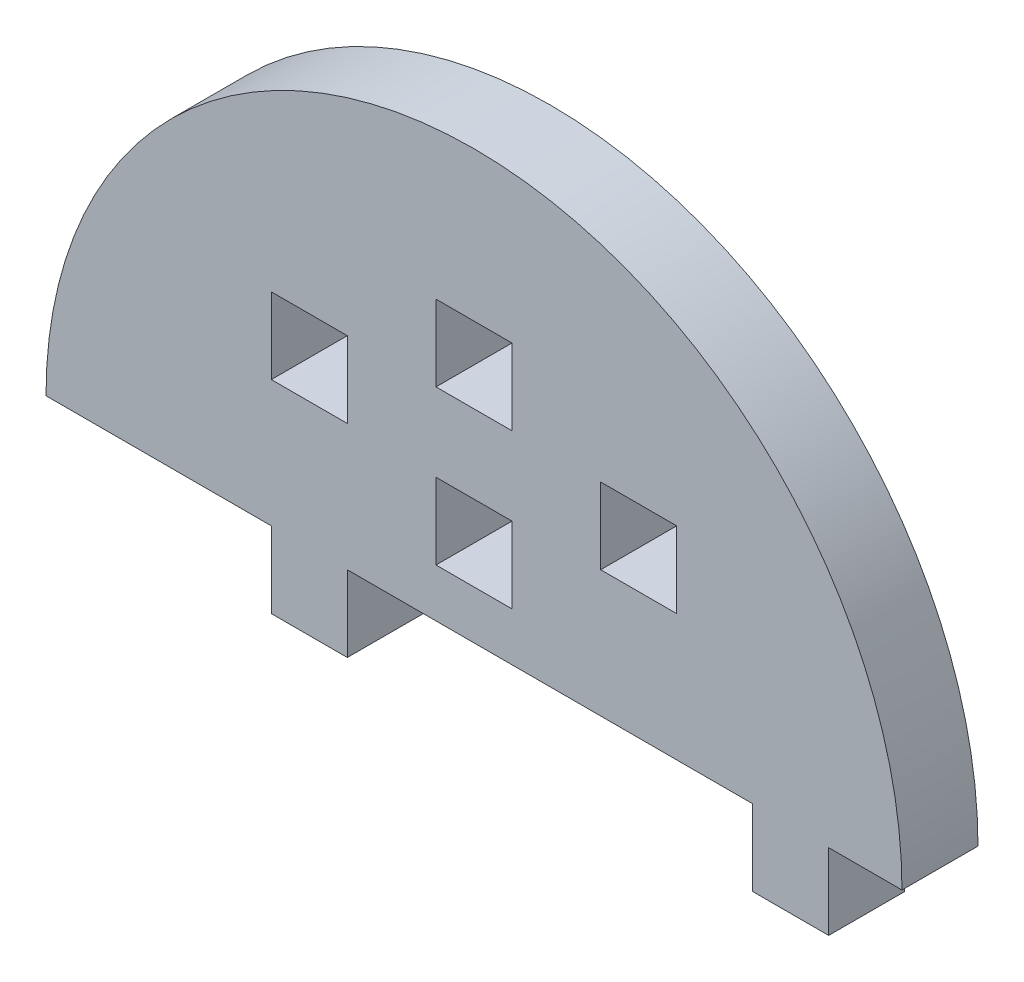
ISO-10303-21;
HEADER;
FILE_DESCRIPTION(('STEP AP214'),'2;1');
FILE_NAME('part.step','',(''),(''),'','','');
FILE_SCHEMA(('AUTOMOTIVE_DESIGN { 1 0 10303 214 1 1 1 1 }'));
ENDSEC;
DATA;
#1=APPLICATION_CONTEXT('core data for automotive mechanical design processes');
#2=APPLICATION_PROTOCOL_DEFINITION('international standard','automotive_design',2000,#1);
#3=PRODUCT_CONTEXT('',#1,'mechanical');
#4=PRODUCT('Part','Part','',(#3));
#5=PRODUCT_RELATED_PRODUCT_CATEGORY('part','',(#4));
#6=PRODUCT_DEFINITION_FORMATION('','',#4);
#7=PRODUCT_DEFINITION_CONTEXT('part definition',#1,'design');
#8=PRODUCT_DEFINITION('design','',#6,#7);
#9=PRODUCT_DEFINITION_SHAPE('','',#8);
#10=(LENGTH_UNIT() NAMED_UNIT(*) SI_UNIT(.MILLI.,.METRE.));
#11=(NAMED_UNIT(*) PLANE_ANGLE_UNIT() SI_UNIT($,.RADIAN.));
#12=(NAMED_UNIT(*) SI_UNIT($,.STERADIAN.) SOLID_ANGLE_UNIT());
#13=UNCERTAINTY_MEASURE_WITH_UNIT(LENGTH_MEASURE(1.E-05),#10,'distance_accuracy_value','');
#14=(GEOMETRIC_REPRESENTATION_CONTEXT(3) GLOBAL_UNCERTAINTY_ASSIGNED_CONTEXT((#13)) GLOBAL_UNIT_ASSIGNED_CONTEXT((#10,
#11,#12)) REPRESENTATION_CONTEXT('',''));
#15=CARTESIAN_POINT('',(0.,0.,0.));
#16=DIRECTION('',(0.,0.,1.));
#17=DIRECTION('',(1.,0.,0.));
#18=AXIS2_PLACEMENT_3D('',#15,#16,#17);
#19=CARTESIAN_POINT('',(3948.27341572013,1132.70473007748,6.));
#20=DIRECTION('',(0.,0.,1.));
#21=DIRECTION('',(1.,0.,0.));
#22=AXIS2_PLACEMENT_3D('',#19,#20,#21);
#23=PLANE('',#22);
#24=DIRECTION('',(-1.,0.,0.));
#25=VECTOR('',#24,1.);
#26=CARTESIAN_POINT('',(3951.27341572013,1148.70473007748,6.));
#27=LINE('',#26,#25);
#28=CARTESIAN_POINT('',(3951.27341572013,1148.70473007748,6.));
#29=VERTEX_POINT('',#28);
#30=CARTESIAN_POINT('',(3945.27341572013,1148.70473007748,6.));
#31=VERTEX_POINT('',#30);
#32=EDGE_CURVE('E383',#29,#31,#27,.T.);
#33=ORIENTED_EDGE('',*,*,#32,.T.);
#34=DIRECTION('',(0.,1.,0.));
#35=VECTOR('',#34,1.);
#36=CARTESIAN_POINT('',(3945.27341572013,1148.70473007748,6.));
#37=LINE('',#36,#35);
#38=CARTESIAN_POINT('',(3945.27341572013,1154.70473007748,6.));
#39=VERTEX_POINT('',#38);
#40=EDGE_CURVE('E393',#31,#39,#37,.T.);
#41=ORIENTED_EDGE('',*,*,#40,.T.);
#42=DIRECTION('',(1.,0.,0.));
#43=VECTOR('',#42,1.);
#44=CARTESIAN_POINT('',(3945.27341572013,1154.70473007748,6.));
#45=LINE('',#44,#43);
#46=CARTESIAN_POINT('',(3951.27341572013,1154.70473007748,6.));
#47=VERTEX_POINT('',#46);
#48=EDGE_CURVE('E223',#39,#47,#45,.T.);
#49=ORIENTED_EDGE('',*,*,#48,.T.);
#50=DIRECTION('',(0.,-1.,0.));
#51=VECTOR('',#50,1.);
#52=CARTESIAN_POINT('',(3951.27341572013,1154.70473007748,6.));
#53=LINE('',#52,#51);
#54=EDGE_CURVE('E390',#47,#29,#53,.T.);
#55=ORIENTED_EDGE('',*,*,#54,.T.);
#56=EDGE_LOOP('',(#33,#41,#49,#55));
#57=FACE_BOUND('',#56,.T.);
#58=DIRECTION('',(0.,1.,0.));
#59=VECTOR('',#58,1.);
#60=CARTESIAN_POINT('',(3958.27341572013,0.,6.));
#61=LINE('',#60,#59);
#62=CARTESIAN_POINT('',(3958.27341572013,1142.70473007748,6.));
#63=VERTEX_POINT('',#62);
#64=CARTESIAN_POINT('',(3958.27341572013,1148.70473007748,6.));
#65=VERTEX_POINT('',#64);
#66=EDGE_CURVE('E429',#63,#65,#61,.T.);
#67=ORIENTED_EDGE('',*,*,#66,.T.);
#68=DIRECTION('',(1.,0.,0.));
#69=VECTOR('',#68,1.);
#70=CARTESIAN_POINT('',(0.,1148.70473007748,6.));
#71=LINE('',#70,#69);
#72=CARTESIAN_POINT('',(3964.27341572013,1148.70473007748,6.));
#73=VERTEX_POINT('',#72);
#74=EDGE_CURVE('E442',#65,#73,#71,.T.);
#75=ORIENTED_EDGE('',*,*,#74,.T.);
#76=DIRECTION('',(0.,-1.,0.));
#77=VECTOR('',#76,1.);
#78=CARTESIAN_POINT('',(3964.27341572013,0.,6.));
#79=LINE('',#78,#77);
#80=CARTESIAN_POINT('',(3964.27341572013,1142.70473007748,6.));
#81=VERTEX_POINT('',#80);
#82=EDGE_CURVE('E438',#73,#81,#79,.T.);
#83=ORIENTED_EDGE('',*,*,#82,.T.);
#84=DIRECTION('',(-1.,0.,0.));
#85=VECTOR('',#84,1.);
#86=CARTESIAN_POINT('',(0.,1142.70473007748,6.));
#87=LINE('',#86,#85);
#88=EDGE_CURVE('E433',#81,#63,#87,.T.);
#89=ORIENTED_EDGE('',*,*,#88,.T.);
#90=EDGE_LOOP('',(#67,#75,#83,#89));
#91=FACE_BOUND('',#90,.T.);
#92=DIRECTION('',(1.,0.,0.));
#93=VECTOR('',#92,1.);
#94=CARTESIAN_POINT('',(3976.27341572013,1132.70473007748,6.));
#95=LINE('',#94,#93);
#96=CARTESIAN_POINT('',(3976.27341572013,1132.70473007748,6.));
#97=VERTEX_POINT('',#96);
#98=CARTESIAN_POINT('',(3982.05913000584,1132.70473007748,6.));
#99=VERTEX_POINT('',#98);
#100=EDGE_CURVE('E559',#97,#99,#95,.T.);
#101=ORIENTED_EDGE('',*,*,#100,.T.);
#102=CARTESIAN_POINT('',(3948.27341572013,1132.70473007748,6.));
#103=DIRECTION('',(0.,0.,1.));
#104=DIRECTION('',(1.,0.,0.));
#105=AXIS2_PLACEMENT_3D('',#102,#103,#104);
#106=CIRCLE('',#105,33.7857142857145);
#107=CARTESIAN_POINT('',(3914.48770143441,1132.70473007748,6.));
#108=VERTEX_POINT('',#107);
#109=EDGE_CURVE('E563',#99,#108,#106,.T.);
#110=ORIENTED_EDGE('',*,*,#109,.T.);
#111=DIRECTION('',(1.,0.,0.));
#112=VECTOR('',#111,1.);
#113=CARTESIAN_POINT('',(3914.48770143441,1132.70473007748,6.));
#114=LINE('',#113,#112);
#115=CARTESIAN_POINT('',(3932.27341572013,1132.70473007748,6.));
#116=VERTEX_POINT('',#115);
#117=EDGE_CURVE('E567',#108,#116,#114,.T.);
#118=ORIENTED_EDGE('',*,*,#117,.T.);
#119=DIRECTION('',(0.,1.,0.));
#120=VECTOR('',#119,1.);
#121=CARTESIAN_POINT('',(3932.27341572013,1126.70473007748,6.));
#122=LINE('',#121,#120);
#123=CARTESIAN_POINT('',(3932.27341572013,1126.70473007748,6.));
#124=VERTEX_POINT('',#123);
#125=EDGE_CURVE('E570',#124,#116,#122,.T.);
#126=ORIENTED_EDGE('',*,*,#125,.F.);
#127=DIRECTION('',(-1.,0.,0.));
#128=VECTOR('',#127,1.);
#129=CARTESIAN_POINT('',(3938.27341572013,1126.70473007748,6.));
#130=LINE('',#129,#128);
#131=CARTESIAN_POINT('',(3938.27341572013,1126.70473007748,6.));
#132=VERTEX_POINT('',#131);
#133=EDGE_CURVE('E574',#132,#124,#130,.T.);
#134=ORIENTED_EDGE('',*,*,#133,.F.);
#135=DIRECTION('',(0.,-1.,0.));
#136=VECTOR('',#135,1.);
#137=CARTESIAN_POINT('',(3938.27341572013,1132.70473007748,6.));
#138=LINE('',#137,#136);
#139=CARTESIAN_POINT('',(3938.27341572013,1132.70473007748,6.));
#140=VERTEX_POINT('',#139);
#141=EDGE_CURVE('E578',#140,#132,#138,.T.);
#142=ORIENTED_EDGE('',*,*,#141,.F.);
#143=DIRECTION('',(1.,0.,0.));
#144=VECTOR('',#143,1.);
#145=CARTESIAN_POINT('',(3938.27341572013,1132.70473007748,6.));
#146=LINE('',#145,#144);
#147=CARTESIAN_POINT('',(3970.27341572013,1132.70473007748,6.));
#148=VERTEX_POINT('',#147);
#149=EDGE_CURVE('E582',#140,#148,#146,.T.);
#150=ORIENTED_EDGE('',*,*,#149,.T.);
#151=DIRECTION('',(0.,-1.,0.));
#152=VECTOR('',#151,1.);
#153=CARTESIAN_POINT('',(3970.27341572013,1132.70473007748,6.));
#154=LINE('',#153,#152);
#155=CARTESIAN_POINT('',(3970.27341572013,1126.70473007748,6.));
#156=VERTEX_POINT('',#155);
#157=EDGE_CURVE('E585',#148,#156,#154,.T.);
#158=ORIENTED_EDGE('',*,*,#157,.T.);
#159=DIRECTION('',(1.,0.,0.));
#160=VECTOR('',#159,1.);
#161=CARTESIAN_POINT('',(3970.27341572013,1126.70473007748,6.));
#162=LINE('',#161,#160);
#163=CARTESIAN_POINT('',(3976.27341572013,1126.70473007748,6.));
#164=VERTEX_POINT('',#163);
#165=EDGE_CURVE('E588',#156,#164,#162,.T.);
#166=ORIENTED_EDGE('',*,*,#165,.T.);
#167=DIRECTION('',(0.,1.,0.));
#168=VECTOR('',#167,1.);
#169=CARTESIAN_POINT('',(3976.27341572013,1126.70473007748,6.));
#170=LINE('',#169,#168);
#171=EDGE_CURVE('E591',#164,#97,#170,.T.);
#172=ORIENTED_EDGE('',*,*,#171,.T.);
#173=EDGE_LOOP('',(#101,#110,#118,#126,#134,#142,#150,#158,#166,#172));
#174=FACE_BOUND('',#173,.T.);
#175=DIRECTION('',(0.,1.,0.));
#176=VECTOR('',#175,1.);
#177=CARTESIAN_POINT('',(3938.27341572013,0.,6.));
#178=LINE('',#177,#176);
#179=CARTESIAN_POINT('',(3938.27341572013,1142.70473007748,6.));
#180=VERTEX_POINT('',#179);
#181=CARTESIAN_POINT('',(3938.27341572013,1148.70473007748,6.));
#182=VERTEX_POINT('',#181);
#183=EDGE_CURVE('E519',#180,#182,#178,.T.);
#184=ORIENTED_EDGE('',*,*,#183,.F.);
#185=DIRECTION('',(1.,0.,0.));
#186=VECTOR('',#185,1.);
#187=CARTESIAN_POINT('',(0.,1142.70473007748,6.));
#188=LINE('',#187,#186);
#189=CARTESIAN_POINT('',(3932.27341572013,1142.70473007748,6.));
#190=VERTEX_POINT('',#189);
#191=EDGE_CURVE('E516',#190,#180,#188,.T.);
#192=ORIENTED_EDGE('',*,*,#191,.F.);
#193=DIRECTION('',(0.,-1.,0.));
#194=VECTOR('',#193,1.);
#195=CARTESIAN_POINT('',(3932.27341572013,0.,6.));
#196=LINE('',#195,#194);
#197=CARTESIAN_POINT('',(3932.27341572013,1148.70473007748,6.));
#198=VERTEX_POINT('',#197);
#199=EDGE_CURVE('E527',#198,#190,#196,.T.);
#200=ORIENTED_EDGE('',*,*,#199,.F.);
#201=DIRECTION('',(-1.,0.,0.));
#202=VECTOR('',#201,1.);
#203=CARTESIAN_POINT('',(0.,1148.70473007748,6.));
#204=LINE('',#203,#202);
#205=EDGE_CURVE('E523',#182,#198,#204,.T.);
#206=ORIENTED_EDGE('',*,*,#205,.F.);
#207=EDGE_LOOP('',(#184,#192,#200,#206));
#208=FACE_BOUND('',#207,.T.);
#209=DIRECTION('',(0.,-1.,0.));
#210=VECTOR('',#209,1.);
#211=CARTESIAN_POINT('',(3945.27341572013,0.,6.));
#212=LINE('',#211,#210);
#213=CARTESIAN_POINT('',(3945.27341572013,1142.52918891089,6.));
#214=VERTEX_POINT('',#213);
#215=CARTESIAN_POINT('',(3945.27341572013,1136.52918891089,6.));
#216=VERTEX_POINT('',#215);
#217=EDGE_CURVE('E476',#214,#216,#212,.T.);
#218=ORIENTED_EDGE('',*,*,#217,.F.);
#219=DIRECTION('',(-1.,0.,0.));
#220=VECTOR('',#219,1.);
#221=CARTESIAN_POINT('',(0.,1142.52918891089,6.));
#222=LINE('',#221,#220);
#223=CARTESIAN_POINT('',(3951.27341572013,1142.52918891089,6.));
#224=VERTEX_POINT('',#223);
#225=EDGE_CURVE('E473',#224,#214,#222,.T.);
#226=ORIENTED_EDGE('',*,*,#225,.F.);
#227=DIRECTION('',(0.,1.,0.));
#228=VECTOR('',#227,1.);
#229=CARTESIAN_POINT('',(3951.27341572013,0.,6.));
#230=LINE('',#229,#228);
#231=CARTESIAN_POINT('',(3951.27341572013,1136.52918891089,6.));
#232=VERTEX_POINT('',#231);
#233=EDGE_CURVE('E484',#232,#224,#230,.T.);
#234=ORIENTED_EDGE('',*,*,#233,.F.);
#235=DIRECTION('',(1.,0.,0.));
#236=VECTOR('',#235,1.);
#237=CARTESIAN_POINT('',(0.,1136.52918891089,6.));
#238=LINE('',#237,#236);
#239=EDGE_CURVE('E480',#216,#232,#238,.T.);
#240=ORIENTED_EDGE('',*,*,#239,.F.);
#241=EDGE_LOOP('',(#218,#226,#234,#240));
#242=FACE_BOUND('',#241,.T.);
#243=ADVANCED_FACE('F207',(#57,#91,#174,#208,#242),#23,.T.);
#244=CARTESIAN_POINT('',(3948.27341572013,1132.70473007748,0.));
#245=DIRECTION('',(0.,0.,1.));
#246=DIRECTION('',(1.,0.,0.));
#247=AXIS2_PLACEMENT_3D('',#244,#245,#246);
#248=PLANE('',#247);
#249=DIRECTION('',(0.,1.,0.));
#250=VECTOR('',#249,1.);
#251=CARTESIAN_POINT('',(3945.27341572013,1148.70473007748,0.));
#252=LINE('',#251,#250);
#253=CARTESIAN_POINT('',(3945.27341572013,1148.70473007748,0.));
#254=VERTEX_POINT('',#253);
#255=CARTESIAN_POINT('',(3945.27341572013,1154.70473007748,0.));
#256=VERTEX_POINT('',#255);
#257=EDGE_CURVE('E414',#254,#256,#252,.T.);
#258=ORIENTED_EDGE('',*,*,#257,.F.);
#259=DIRECTION('',(-1.,0.,0.));
#260=VECTOR('',#259,1.);
#261=CARTESIAN_POINT('',(3951.27341572013,1148.70473007748,0.));
#262=LINE('',#261,#260);
#263=CARTESIAN_POINT('',(3951.27341572013,1148.70473007748,0.));
#264=VERTEX_POINT('',#263);
#265=EDGE_CURVE('E231',#264,#254,#262,.T.);
#266=ORIENTED_EDGE('',*,*,#265,.F.);
#267=DIRECTION('',(0.,-1.,0.));
#268=VECTOR('',#267,1.);
#269=CARTESIAN_POINT('',(3951.27341572013,1154.70473007748,0.));
#270=LINE('',#269,#268);
#271=CARTESIAN_POINT('',(3951.27341572013,1154.70473007748,0.));
#272=VERTEX_POINT('',#271);
#273=EDGE_CURVE('E401',#272,#264,#270,.T.);
#274=ORIENTED_EDGE('',*,*,#273,.F.);
#275=DIRECTION('',(1.,0.,0.));
#276=VECTOR('',#275,1.);
#277=CARTESIAN_POINT('',(3945.27341572013,1154.70473007748,0.));
#278=LINE('',#277,#276);
#279=EDGE_CURVE('E405',#256,#272,#278,.T.);
#280=ORIENTED_EDGE('',*,*,#279,.F.);
#281=EDGE_LOOP('',(#258,#266,#274,#280));
#282=FACE_BOUND('',#281,.T.);
#283=DIRECTION('',(1.,0.,0.));
#284=VECTOR('',#283,1.);
#285=CARTESIAN_POINT('',(0.,1148.70473007748,0.));
#286=LINE('',#285,#284);
#287=CARTESIAN_POINT('',(3958.27341572013,1148.70473007748,0.));
#288=VERTEX_POINT('',#287);
#289=CARTESIAN_POINT('',(3964.27341572013,1148.70473007748,0.));
#290=VERTEX_POINT('',#289);
#291=EDGE_CURVE('E434',#288,#290,#286,.T.);
#292=ORIENTED_EDGE('',*,*,#291,.F.);
#293=DIRECTION('',(0.,1.,0.));
#294=VECTOR('',#293,1.);
#295=CARTESIAN_POINT('',(3958.27341572013,0.,0.));
#296=LINE('',#295,#294);
#297=CARTESIAN_POINT('',(3958.27341572013,1142.70473007748,0.));
#298=VERTEX_POINT('',#297);
#299=EDGE_CURVE('E423',#298,#288,#296,.T.);
#300=ORIENTED_EDGE('',*,*,#299,.F.);
#301=DIRECTION('',(-1.,0.,0.));
#302=VECTOR('',#301,1.);
#303=CARTESIAN_POINT('',(0.,1142.70473007748,0.));
#304=LINE('',#303,#302);
#305=CARTESIAN_POINT('',(3964.27341572013,1142.70473007748,0.));
#306=VERTEX_POINT('',#305);
#307=EDGE_CURVE('E449',#306,#298,#304,.T.);
#308=ORIENTED_EDGE('',*,*,#307,.F.);
#309=DIRECTION('',(0.,-1.,0.));
#310=VECTOR('',#309,1.);
#311=CARTESIAN_POINT('',(3964.27341572013,0.,0.));
#312=LINE('',#311,#310);
#313=EDGE_CURVE('E453',#290,#306,#312,.T.);
#314=ORIENTED_EDGE('',*,*,#313,.F.);
#315=EDGE_LOOP('',(#292,#300,#308,#314));
#316=FACE_BOUND('',#315,.T.);
#317=DIRECTION('',(1.,0.,0.));
#318=VECTOR('',#317,1.);
#319=CARTESIAN_POINT('',(0.,1142.70473007748,0.));
#320=LINE('',#319,#318);
#321=CARTESIAN_POINT('',(3932.27341572013,1142.70473007748,0.));
#322=VERTEX_POINT('',#321);
#323=CARTESIAN_POINT('',(3938.27341572013,1142.70473007748,0.));
#324=VERTEX_POINT('',#323);
#325=EDGE_CURVE('E515',#322,#324,#320,.T.);
#326=ORIENTED_EDGE('',*,*,#325,.T.);
#327=DIRECTION('',(0.,1.,0.));
#328=VECTOR('',#327,1.);
#329=CARTESIAN_POINT('',(3938.27341572013,0.,0.));
#330=LINE('',#329,#328);
#331=CARTESIAN_POINT('',(3938.27341572013,1148.70473007748,0.));
#332=VERTEX_POINT('',#331);
#333=EDGE_CURVE('E534',#324,#332,#330,.T.);
#334=ORIENTED_EDGE('',*,*,#333,.T.);
#335=DIRECTION('',(-1.,0.,0.));
#336=VECTOR('',#335,1.);
#337=CARTESIAN_POINT('',(0.,1148.70473007748,0.));
#338=LINE('',#337,#336);
#339=CARTESIAN_POINT('',(3932.27341572013,1148.70473007748,0.));
#340=VERTEX_POINT('',#339);
#341=EDGE_CURVE('E538',#332,#340,#338,.T.);
#342=ORIENTED_EDGE('',*,*,#341,.T.);
#343=DIRECTION('',(0.,-1.,0.));
#344=VECTOR('',#343,1.);
#345=CARTESIAN_POINT('',(3932.27341572013,0.,0.));
#346=LINE('',#345,#344);
#347=EDGE_CURVE('E520',#340,#322,#346,.T.);
#348=ORIENTED_EDGE('',*,*,#347,.T.);
#349=EDGE_LOOP('',(#326,#334,#342,#348));
#350=FACE_BOUND('',#349,.T.);
#351=DIRECTION('',(1.,0.,0.));
#352=VECTOR('',#351,1.);
#353=CARTESIAN_POINT('',(3976.27341572013,1132.70473007748,0.));
#354=LINE('',#353,#352);
#355=CARTESIAN_POINT('',(3976.27341572013,1132.70473007748,0.));
#356=VERTEX_POINT('',#355);
#357=CARTESIAN_POINT('',(3982.05913000584,1132.70473007748,0.));
#358=VERTEX_POINT('',#357);
#359=EDGE_CURVE('E558',#356,#358,#354,.T.);
#360=ORIENTED_EDGE('',*,*,#359,.F.);
#361=DIRECTION('',(0.,1.,0.));
#362=VECTOR('',#361,1.);
#363=CARTESIAN_POINT('',(3976.27341572013,1126.70473007748,0.));
#364=LINE('',#363,#362);
#365=CARTESIAN_POINT('',(3976.27341572013,1126.70473007748,0.));
#366=VERTEX_POINT('',#365);
#367=EDGE_CURVE('E564',#366,#356,#364,.T.);
#368=ORIENTED_EDGE('',*,*,#367,.F.);
#369=DIRECTION('',(1.,0.,0.));
#370=VECTOR('',#369,1.);
#371=CARTESIAN_POINT('',(3970.27341572013,1126.70473007748,0.));
#372=LINE('',#371,#370);
#373=CARTESIAN_POINT('',(3970.27341572013,1126.70473007748,0.));
#374=VERTEX_POINT('',#373);
#375=EDGE_CURVE('E623',#374,#366,#372,.T.);
#376=ORIENTED_EDGE('',*,*,#375,.F.);
#377=DIRECTION('',(0.,-1.,0.));
#378=VECTOR('',#377,1.);
#379=CARTESIAN_POINT('',(3970.27341572013,1132.70473007748,0.));
#380=LINE('',#379,#378);
#381=CARTESIAN_POINT('',(3970.27341572013,1132.70473007748,0.));
#382=VERTEX_POINT('',#381);
#383=EDGE_CURVE('E620',#382,#374,#380,.T.);
#384=ORIENTED_EDGE('',*,*,#383,.F.);
#385=DIRECTION('',(1.,0.,0.));
#386=VECTOR('',#385,1.);
#387=CARTESIAN_POINT('',(3938.27341572013,1132.70473007748,0.));
#388=LINE('',#387,#386);
#389=CARTESIAN_POINT('',(3938.27341572013,1132.70473007748,0.));
#390=VERTEX_POINT('',#389);
#391=EDGE_CURVE('E617',#390,#382,#388,.T.);
#392=ORIENTED_EDGE('',*,*,#391,.F.);
#393=DIRECTION('',(0.,-1.,0.));
#394=VECTOR('',#393,1.);
#395=CARTESIAN_POINT('',(3938.27341572013,1132.70473007748,0.));
#396=LINE('',#395,#394);
#397=CARTESIAN_POINT('',(3938.27341572013,1126.70473007748,0.));
#398=VERTEX_POINT('',#397);
#399=EDGE_CURVE('E613',#390,#398,#396,.T.);
#400=ORIENTED_EDGE('',*,*,#399,.T.);
#401=DIRECTION('',(-1.,0.,0.));
#402=VECTOR('',#401,1.);
#403=CARTESIAN_POINT('',(3938.27341572013,1126.70473007748,0.));
#404=LINE('',#403,#402);
#405=CARTESIAN_POINT('',(3932.27341572013,1126.70473007748,0.));
#406=VERTEX_POINT('',#405);
#407=EDGE_CURVE('E609',#398,#406,#404,.T.);
#408=ORIENTED_EDGE('',*,*,#407,.T.);
#409=DIRECTION('',(0.,1.,0.));
#410=VECTOR('',#409,1.);
#411=CARTESIAN_POINT('',(3932.27341572013,1126.70473007748,0.));
#412=LINE('',#411,#410);
#413=CARTESIAN_POINT('',(3932.27341572013,1132.70473007748,0.));
#414=VERTEX_POINT('',#413);
#415=EDGE_CURVE('E605',#406,#414,#412,.T.);
#416=ORIENTED_EDGE('',*,*,#415,.T.);
#417=DIRECTION('',(1.,0.,0.));
#418=VECTOR('',#417,1.);
#419=CARTESIAN_POINT('',(3914.48770143441,1132.70473007748,0.));
#420=LINE('',#419,#418);
#421=CARTESIAN_POINT('',(3914.48770143441,1132.70473007748,0.));
#422=VERTEX_POINT('',#421);
#423=EDGE_CURVE('E601',#422,#414,#420,.T.);
#424=ORIENTED_EDGE('',*,*,#423,.F.);
#425=CARTESIAN_POINT('',(3948.27341572013,1132.70473007748,0.));
#426=DIRECTION('',(0.,0.,1.));
#427=DIRECTION('',(1.,0.,0.));
#428=AXIS2_PLACEMENT_3D('',#425,#426,#427);
#429=CIRCLE('',#428,33.7857142857145);
#430=EDGE_CURVE('E598',#358,#422,#429,.T.);
#431=ORIENTED_EDGE('',*,*,#430,.F.);
#432=EDGE_LOOP('',(#360,#368,#376,#384,#392,#400,#408,#416,#424,#431));
#433=FACE_BOUND('',#432,.T.);
#434=DIRECTION('',(-1.,0.,0.));
#435=VECTOR('',#434,1.);
#436=CARTESIAN_POINT('',(0.,1142.52918891089,0.));
#437=LINE('',#436,#435);
#438=CARTESIAN_POINT('',(3951.27341572013,1142.52918891089,0.));
#439=VERTEX_POINT('',#438);
#440=CARTESIAN_POINT('',(3945.27341572013,1142.52918891089,0.));
#441=VERTEX_POINT('',#440);
#442=EDGE_CURVE('E472',#439,#441,#437,.T.);
#443=ORIENTED_EDGE('',*,*,#442,.T.);
#444=DIRECTION('',(0.,-1.,0.));
#445=VECTOR('',#444,1.);
#446=CARTESIAN_POINT('',(3945.27341572013,0.,0.));
#447=LINE('',#446,#445);
#448=CARTESIAN_POINT('',(3945.27341572013,1136.52918891089,0.));
#449=VERTEX_POINT('',#448);
#450=EDGE_CURVE('E491',#441,#449,#447,.T.);
#451=ORIENTED_EDGE('',*,*,#450,.T.);
#452=DIRECTION('',(1.,0.,0.));
#453=VECTOR('',#452,1.);
#454=CARTESIAN_POINT('',(0.,1136.52918891089,0.));
#455=LINE('',#454,#453);
#456=CARTESIAN_POINT('',(3951.27341572013,1136.52918891089,0.));
#457=VERTEX_POINT('',#456);
#458=EDGE_CURVE('E495',#449,#457,#455,.T.);
#459=ORIENTED_EDGE('',*,*,#458,.T.);
#460=DIRECTION('',(0.,1.,0.));
#461=VECTOR('',#460,1.);
#462=CARTESIAN_POINT('',(3951.27341572013,0.,0.));
#463=LINE('',#462,#461);
#464=EDGE_CURVE('E477',#457,#439,#463,.T.);
#465=ORIENTED_EDGE('',*,*,#464,.T.);
#466=EDGE_LOOP('',(#443,#451,#459,#465));
#467=FACE_BOUND('',#466,.T.);
#468=ADVANCED_FACE('F665',(#282,#316,#350,#433,#467),#248,.F.);
#469=CARTESIAN_POINT('',(3976.27341572013,1132.70473007748,6.));
#470=DIRECTION('',(0.,1.,0.));
#471=DIRECTION('',(0.,0.,1.));
#472=AXIS2_PLACEMENT_3D('',#469,#470,#471);
#473=PLANE('',#472);
#474=ORIENTED_EDGE('',*,*,#359,.T.);
#475=DIRECTION('',(0.,0.,-1.));
#476=VECTOR('',#475,1.);
#477=CARTESIAN_POINT('',(3982.05913000584,1132.70473007748,6.));
#478=LINE('',#477,#476);
#479=EDGE_CURVE('E12',#99,#358,#478,.T.);
#480=ORIENTED_EDGE('',*,*,#479,.F.);
#481=ORIENTED_EDGE('',*,*,#100,.F.);
#482=DIRECTION('',(0.,0.,-1.));
#483=VECTOR('',#482,1.);
#484=CARTESIAN_POINT('',(3976.27341572013,1132.70473007748,6.));
#485=LINE('',#484,#483);
#486=EDGE_CURVE('E594',#97,#356,#485,.T.);
#487=ORIENTED_EDGE('',*,*,#486,.T.);
#488=EDGE_LOOP('',(#474,#480,#481,#487));
#489=FACE_BOUND('',#488,.T.);
#490=ADVANCED_FACE('F209',(#489),#473,.F.);
#491=CARTESIAN_POINT('',(3948.27341572013,1132.70473007748,6.));
#492=DIRECTION('',(0.,0.,-1.));
#493=DIRECTION('',(-1.,0.,0.));
#494=AXIS2_PLACEMENT_3D('',#491,#492,#493);
#495=CYLINDRICAL_SURFACE('',#494,33.7857142857145);
#496=ORIENTED_EDGE('',*,*,#430,.T.);
#497=DIRECTION('',(0.,0.,-1.));
#498=VECTOR('',#497,1.);
#499=CARTESIAN_POINT('',(3914.48770143441,1132.70473007748,6.));
#500=LINE('',#499,#498);
#501=EDGE_CURVE('E216',#108,#422,#500,.T.);
#502=ORIENTED_EDGE('',*,*,#501,.F.);
#503=ORIENTED_EDGE('',*,*,#109,.F.);
#504=ORIENTED_EDGE('',*,*,#479,.T.);
#505=EDGE_LOOP('',(#496,#502,#503,#504));
#506=FACE_BOUND('',#505,.T.);
#507=ADVANCED_FACE('F704',(#506),#495,.T.);
#508=CARTESIAN_POINT('',(3914.48770143441,1132.70473007748,6.));
#509=DIRECTION('',(0.,1.,0.));
#510=DIRECTION('',(0.,0.,1.));
#511=AXIS2_PLACEMENT_3D('',#508,#509,#510);
#512=PLANE('',#511);
#513=ORIENTED_EDGE('',*,*,#423,.T.);
#514=DIRECTION('',(0.,0.,-1.));
#515=VECTOR('',#514,1.);
#516=CARTESIAN_POINT('',(3932.27341572013,1132.70473007748,6.));
#517=LINE('',#516,#515);
#518=EDGE_CURVE('E652',#116,#414,#517,.T.);
#519=ORIENTED_EDGE('',*,*,#518,.F.);
#520=ORIENTED_EDGE('',*,*,#117,.F.);
#521=ORIENTED_EDGE('',*,*,#501,.T.);
#522=EDGE_LOOP('',(#513,#519,#520,#521));
#523=FACE_BOUND('',#522,.T.);
#524=ADVANCED_FACE('F660',(#523),#512,.F.);
#525=CARTESIAN_POINT('',(3932.27341572013,1126.70473007748,6.));
#526=DIRECTION('',(-1.,0.,0.));
#527=DIRECTION('',(0.,0.,1.));
#528=AXIS2_PLACEMENT_3D('',#525,#526,#527);
#529=PLANE('',#528);
#530=ORIENTED_EDGE('',*,*,#415,.F.);
#531=DIRECTION('',(0.,0.,-1.));
#532=VECTOR('',#531,1.);
#533=CARTESIAN_POINT('',(3932.27341572013,1126.70473007748,6.));
#534=LINE('',#533,#532);
#535=EDGE_CURVE('E649',#124,#406,#534,.T.);
#536=ORIENTED_EDGE('',*,*,#535,.F.);
#537=ORIENTED_EDGE('',*,*,#125,.T.);
#538=ORIENTED_EDGE('',*,*,#518,.T.);
#539=EDGE_LOOP('',(#530,#536,#537,#538));
#540=FACE_BOUND('',#539,.T.);
#541=ADVANCED_FACE('F670',(#540),#529,.T.);
#542=CARTESIAN_POINT('',(3938.27341572013,1126.70473007748,6.));
#543=DIRECTION('',(0.,-1.,0.));
#544=DIRECTION('',(0.,0.,-1.));
#545=AXIS2_PLACEMENT_3D('',#542,#543,#544);
#546=PLANE('',#545);
#547=ORIENTED_EDGE('',*,*,#407,.F.);
#548=DIRECTION('',(0.,0.,-1.));
#549=VECTOR('',#548,1.);
#550=CARTESIAN_POINT('',(3938.27341572013,1126.70473007748,6.));
#551=LINE('',#550,#549);
#552=EDGE_CURVE('E646',#132,#398,#551,.T.);
#553=ORIENTED_EDGE('',*,*,#552,.F.);
#554=ORIENTED_EDGE('',*,*,#133,.T.);
#555=ORIENTED_EDGE('',*,*,#535,.T.);
#556=EDGE_LOOP('',(#547,#553,#554,#555));
#557=FACE_BOUND('',#556,.T.);
#558=ADVANCED_FACE('F677',(#557),#546,.T.);
#559=CARTESIAN_POINT('',(3938.27341572013,1132.70473007748,6.));
#560=DIRECTION('',(1.,0.,0.));
#561=DIRECTION('',(0.,0.,-1.));
#562=AXIS2_PLACEMENT_3D('',#559,#560,#561);
#563=PLANE('',#562);
#564=ORIENTED_EDGE('',*,*,#399,.F.);
#565=DIRECTION('',(0.,0.,-1.));
#566=VECTOR('',#565,1.);
#567=CARTESIAN_POINT('',(3938.27341572013,1132.70473007748,6.));
#568=LINE('',#567,#566);
#569=EDGE_CURVE('E643',#140,#390,#568,.T.);
#570=ORIENTED_EDGE('',*,*,#569,.F.);
#571=ORIENTED_EDGE('',*,*,#141,.T.);
#572=ORIENTED_EDGE('',*,*,#552,.T.);
#573=EDGE_LOOP('',(#564,#570,#571,#572));
#574=FACE_BOUND('',#573,.T.);
#575=ADVANCED_FACE('F680',(#574),#563,.T.);
#576=CARTESIAN_POINT('',(3938.27341572013,1132.70473007748,6.));
#577=DIRECTION('',(0.,1.,0.));
#578=DIRECTION('',(0.,0.,1.));
#579=AXIS2_PLACEMENT_3D('',#576,#577,#578);
#580=PLANE('',#579);
#581=ORIENTED_EDGE('',*,*,#391,.T.);
#582=DIRECTION('',(0.,0.,-1.));
#583=VECTOR('',#582,1.);
#584=CARTESIAN_POINT('',(3970.27341572013,1132.70473007748,6.));
#585=LINE('',#584,#583);
#586=EDGE_CURVE('E639',#148,#382,#585,.T.);
#587=ORIENTED_EDGE('',*,*,#586,.F.);
#588=ORIENTED_EDGE('',*,*,#149,.F.);
#589=ORIENTED_EDGE('',*,*,#569,.T.);
#590=EDGE_LOOP('',(#581,#587,#588,#589));
#591=FACE_BOUND('',#590,.T.);
#592=ADVANCED_FACE('F686',(#591),#580,.F.);
#593=CARTESIAN_POINT('',(3970.27341572013,1132.70473007748,6.));
#594=DIRECTION('',(1.,0.,0.));
#595=DIRECTION('',(0.,0.,-1.));
#596=AXIS2_PLACEMENT_3D('',#593,#594,#595);
#597=PLANE('',#596);
#598=ORIENTED_EDGE('',*,*,#383,.T.);
#599=DIRECTION('',(0.,0.,-1.));
#600=VECTOR('',#599,1.);
#601=CARTESIAN_POINT('',(3970.27341572013,1126.70473007748,6.));
#602=LINE('',#601,#600);
#603=EDGE_CURVE('E635',#156,#374,#602,.T.);
#604=ORIENTED_EDGE('',*,*,#603,.F.);
#605=ORIENTED_EDGE('',*,*,#157,.F.);
#606=ORIENTED_EDGE('',*,*,#586,.T.);
#607=EDGE_LOOP('',(#598,#604,#605,#606));
#608=FACE_BOUND('',#607,.T.);
#609=ADVANCED_FACE('F690',(#608),#597,.F.);
#610=CARTESIAN_POINT('',(3970.27341572013,1126.70473007748,6.));
#611=DIRECTION('',(0.,1.,0.));
#612=DIRECTION('',(0.,0.,1.));
#613=AXIS2_PLACEMENT_3D('',#610,#611,#612);
#614=PLANE('',#613);
#615=ORIENTED_EDGE('',*,*,#375,.T.);
#616=DIRECTION('',(0.,0.,-1.));
#617=VECTOR('',#616,1.);
#618=CARTESIAN_POINT('',(3976.27341572013,1126.70473007748,6.));
#619=LINE('',#618,#617);
#620=EDGE_CURVE('E631',#164,#366,#619,.T.);
#621=ORIENTED_EDGE('',*,*,#620,.F.);
#622=ORIENTED_EDGE('',*,*,#165,.F.);
#623=ORIENTED_EDGE('',*,*,#603,.T.);
#624=EDGE_LOOP('',(#615,#621,#622,#623));
#625=FACE_BOUND('',#624,.T.);
#626=ADVANCED_FACE('F695',(#625),#614,.F.);
#627=CARTESIAN_POINT('',(3976.27341572013,1126.70473007748,6.));
#628=DIRECTION('',(-1.,0.,0.));
#629=DIRECTION('',(0.,0.,1.));
#630=AXIS2_PLACEMENT_3D('',#627,#628,#629);
#631=PLANE('',#630);
#632=ORIENTED_EDGE('',*,*,#367,.T.);
#633=ORIENTED_EDGE('',*,*,#486,.F.);
#634=ORIENTED_EDGE('',*,*,#171,.F.);
#635=ORIENTED_EDGE('',*,*,#620,.T.);
#636=EDGE_LOOP('',(#632,#633,#634,#635));
#637=FACE_BOUND('',#636,.T.);
#638=ADVANCED_FACE('F701',(#637),#631,.F.);
#639=CARTESIAN_POINT('',(0.,1142.70473007748,6.));
#640=DIRECTION('',(0.,1.,0.));
#641=DIRECTION('',(0.,0.,1.));
#642=AXIS2_PLACEMENT_3D('',#639,#640,#641);
#643=PLANE('',#642);
#644=ORIENTED_EDGE('',*,*,#325,.F.);
#645=DIRECTION('',(0.,0.,-1.));
#646=VECTOR('',#645,1.);
#647=CARTESIAN_POINT('',(3932.27341572013,1142.70473007748,6.));
#648=LINE('',#647,#646);
#649=EDGE_CURVE('E530',#190,#322,#648,.T.);
#650=ORIENTED_EDGE('',*,*,#649,.F.);
#651=ORIENTED_EDGE('',*,*,#191,.T.);
#652=DIRECTION('',(0.,0.,-1.));
#653=VECTOR('',#652,1.);
#654=CARTESIAN_POINT('',(3938.27341572013,1142.70473007748,6.));
#655=LINE('',#654,#653);
#656=EDGE_CURVE('E554',#180,#324,#655,.T.);
#657=ORIENTED_EDGE('',*,*,#656,.T.);
#658=EDGE_LOOP('',(#644,#650,#651,#657));
#659=FACE_BOUND('',#658,.T.);
#660=ADVANCED_FACE('F719',(#659),#643,.T.);
#661=CARTESIAN_POINT('',(3938.27341572013,0.,6.));
#662=DIRECTION('',(-1.,0.,0.));
#663=DIRECTION('',(0.,0.,1.));
#664=AXIS2_PLACEMENT_3D('',#661,#662,#663);
#665=PLANE('',#664);
#666=ORIENTED_EDGE('',*,*,#333,.F.);
#667=ORIENTED_EDGE('',*,*,#656,.F.);
#668=ORIENTED_EDGE('',*,*,#183,.T.);
#669=DIRECTION('',(0.,0.,-1.));
#670=VECTOR('',#669,1.);
#671=CARTESIAN_POINT('',(3938.27341572013,1148.70473007748,6.));
#672=LINE('',#671,#670);
#673=EDGE_CURVE('E551',#182,#332,#672,.T.);
#674=ORIENTED_EDGE('',*,*,#673,.T.);
#675=EDGE_LOOP('',(#666,#667,#668,#674));
#676=FACE_BOUND('',#675,.T.);
#677=ADVANCED_FACE('F769',(#676),#665,.T.);
#678=CARTESIAN_POINT('',(0.,1148.70473007748,6.));
#679=DIRECTION('',(0.,-1.,0.));
#680=DIRECTION('',(0.,0.,-1.));
#681=AXIS2_PLACEMENT_3D('',#678,#679,#680);
#682=PLANE('',#681);
#683=ORIENTED_EDGE('',*,*,#341,.F.);
#684=ORIENTED_EDGE('',*,*,#673,.F.);
#685=ORIENTED_EDGE('',*,*,#205,.T.);
#686=DIRECTION('',(0.,0.,-1.));
#687=VECTOR('',#686,1.);
#688=CARTESIAN_POINT('',(3932.27341572013,1148.70473007748,6.));
#689=LINE('',#688,#687);
#690=EDGE_CURVE('E548',#198,#340,#689,.T.);
#691=ORIENTED_EDGE('',*,*,#690,.T.);
#692=EDGE_LOOP('',(#683,#684,#685,#691));
#693=FACE_BOUND('',#692,.T.);
#694=ADVANCED_FACE('F776',(#693),#682,.T.);
#695=CARTESIAN_POINT('',(3932.27341572013,0.,6.));
#696=DIRECTION('',(1.,0.,0.));
#697=DIRECTION('',(0.,0.,-1.));
#698=AXIS2_PLACEMENT_3D('',#695,#696,#697);
#699=PLANE('',#698);
#700=ORIENTED_EDGE('',*,*,#347,.F.);
#701=ORIENTED_EDGE('',*,*,#690,.F.);
#702=ORIENTED_EDGE('',*,*,#199,.T.);
#703=ORIENTED_EDGE('',*,*,#649,.T.);
#704=EDGE_LOOP('',(#700,#701,#702,#703));
#705=FACE_BOUND('',#704,.T.);
#706=ADVANCED_FACE('F783',(#705),#699,.T.);
#707=CARTESIAN_POINT('',(0.,1142.52918891089,6.));
#708=DIRECTION('',(0.,-1.,0.));
#709=DIRECTION('',(0.,0.,-1.));
#710=AXIS2_PLACEMENT_3D('',#707,#708,#709);
#711=PLANE('',#710);
#712=ORIENTED_EDGE('',*,*,#442,.F.);
#713=DIRECTION('',(0.,0.,-1.));
#714=VECTOR('',#713,1.);
#715=CARTESIAN_POINT('',(3951.27341572013,1142.52918891089,6.));
#716=LINE('',#715,#714);
#717=EDGE_CURVE('E487',#224,#439,#716,.T.);
#718=ORIENTED_EDGE('',*,*,#717,.F.);
#719=ORIENTED_EDGE('',*,*,#225,.T.);
#720=DIRECTION('',(0.,0.,-1.));
#721=VECTOR('',#720,1.);
#722=CARTESIAN_POINT('',(3945.27341572013,1142.52918891089,6.));
#723=LINE('',#722,#721);
#724=EDGE_CURVE('E511',#214,#441,#723,.T.);
#725=ORIENTED_EDGE('',*,*,#724,.T.);
#726=EDGE_LOOP('',(#712,#718,#719,#725));
#727=FACE_BOUND('',#726,.T.);
#728=ADVANCED_FACE('F791',(#727),#711,.T.);
#729=CARTESIAN_POINT('',(3945.27341572013,0.,6.));
#730=DIRECTION('',(1.,0.,0.));
#731=DIRECTION('',(0.,0.,-1.));
#732=AXIS2_PLACEMENT_3D('',#729,#730,#731);
#733=PLANE('',#732);
#734=ORIENTED_EDGE('',*,*,#450,.F.);
#735=ORIENTED_EDGE('',*,*,#724,.F.);
#736=ORIENTED_EDGE('',*,*,#217,.T.);
#737=DIRECTION('',(0.,0.,-1.));
#738=VECTOR('',#737,1.);
#739=CARTESIAN_POINT('',(3945.27341572013,1136.52918891089,6.));
#740=LINE('',#739,#738);
#741=EDGE_CURVE('E508',#216,#449,#740,.T.);
#742=ORIENTED_EDGE('',*,*,#741,.T.);
#743=EDGE_LOOP('',(#734,#735,#736,#742));
#744=FACE_BOUND('',#743,.T.);
#745=ADVANCED_FACE('F799',(#744),#733,.T.);
#746=CARTESIAN_POINT('',(0.,1136.52918891089,6.));
#747=DIRECTION('',(0.,1.,0.));
#748=DIRECTION('',(0.,0.,1.));
#749=AXIS2_PLACEMENT_3D('',#746,#747,#748);
#750=PLANE('',#749);
#751=ORIENTED_EDGE('',*,*,#458,.F.);
#752=ORIENTED_EDGE('',*,*,#741,.F.);
#753=ORIENTED_EDGE('',*,*,#239,.T.);
#754=DIRECTION('',(0.,0.,-1.));
#755=VECTOR('',#754,1.);
#756=CARTESIAN_POINT('',(3951.27341572013,1136.52918891089,6.));
#757=LINE('',#756,#755);
#758=EDGE_CURVE('E505',#232,#457,#757,.T.);
#759=ORIENTED_EDGE('',*,*,#758,.T.);
#760=EDGE_LOOP('',(#751,#752,#753,#759));
#761=FACE_BOUND('',#760,.T.);
#762=ADVANCED_FACE('F807',(#761),#750,.T.);
#763=CARTESIAN_POINT('',(3951.27341572013,0.,6.));
#764=DIRECTION('',(-1.,0.,0.));
#765=DIRECTION('',(0.,0.,1.));
#766=AXIS2_PLACEMENT_3D('',#763,#764,#765);
#767=PLANE('',#766);
#768=ORIENTED_EDGE('',*,*,#464,.F.);
#769=ORIENTED_EDGE('',*,*,#758,.F.);
#770=ORIENTED_EDGE('',*,*,#233,.T.);
#771=ORIENTED_EDGE('',*,*,#717,.T.);
#772=EDGE_LOOP('',(#768,#769,#770,#771));
#773=FACE_BOUND('',#772,.T.);
#774=ADVANCED_FACE('F815',(#773),#767,.T.);
#775=CARTESIAN_POINT('',(3958.27341572013,0.,6.));
#776=DIRECTION('',(-1.,0.,0.));
#777=DIRECTION('',(0.,0.,1.));
#778=AXIS2_PLACEMENT_3D('',#775,#776,#777);
#779=PLANE('',#778);
#780=ORIENTED_EDGE('',*,*,#299,.T.);
#781=DIRECTION('',(0.,0.,-1.));
#782=VECTOR('',#781,1.);
#783=CARTESIAN_POINT('',(3958.27341572013,1148.70473007748,6.));
#784=LINE('',#783,#782);
#785=EDGE_CURVE('E446',#65,#288,#784,.T.);
#786=ORIENTED_EDGE('',*,*,#785,.F.);
#787=ORIENTED_EDGE('',*,*,#66,.F.);
#788=DIRECTION('',(0.,0.,-1.));
#789=VECTOR('',#788,1.);
#790=CARTESIAN_POINT('',(3958.27341572013,1142.70473007748,6.));
#791=LINE('',#790,#789);
#792=EDGE_CURVE('E469',#63,#298,#791,.T.);
#793=ORIENTED_EDGE('',*,*,#792,.T.);
#794=EDGE_LOOP('',(#780,#786,#787,#793));
#795=FACE_BOUND('',#794,.T.);
#796=ADVANCED_FACE('F823',(#795),#779,.F.);
#797=CARTESIAN_POINT('',(0.,1142.70473007748,6.));
#798=DIRECTION('',(0.,-1.,0.));
#799=DIRECTION('',(0.,0.,-1.));
#800=AXIS2_PLACEMENT_3D('',#797,#798,#799);
#801=PLANE('',#800);
#802=ORIENTED_EDGE('',*,*,#307,.T.);
#803=ORIENTED_EDGE('',*,*,#792,.F.);
#804=ORIENTED_EDGE('',*,*,#88,.F.);
#805=DIRECTION('',(0.,0.,-1.));
#806=VECTOR('',#805,1.);
#807=CARTESIAN_POINT('',(3964.27341572013,1142.70473007748,6.));
#808=LINE('',#807,#806);
#809=EDGE_CURVE('E466',#81,#306,#808,.T.);
#810=ORIENTED_EDGE('',*,*,#809,.T.);
#811=EDGE_LOOP('',(#802,#803,#804,#810));
#812=FACE_BOUND('',#811,.T.);
#813=ADVANCED_FACE('F831',(#812),#801,.F.);
#814=CARTESIAN_POINT('',(3964.27341572013,0.,6.));
#815=DIRECTION('',(1.,0.,0.));
#816=DIRECTION('',(0.,0.,-1.));
#817=AXIS2_PLACEMENT_3D('',#814,#815,#816);
#818=PLANE('',#817);
#819=ORIENTED_EDGE('',*,*,#313,.T.);
#820=ORIENTED_EDGE('',*,*,#809,.F.);
#821=ORIENTED_EDGE('',*,*,#82,.F.);
#822=DIRECTION('',(0.,0.,-1.));
#823=VECTOR('',#822,1.);
#824=CARTESIAN_POINT('',(3964.27341572013,1148.70473007748,6.));
#825=LINE('',#824,#823);
#826=EDGE_CURVE('E463',#73,#290,#825,.T.);
#827=ORIENTED_EDGE('',*,*,#826,.T.);
#828=EDGE_LOOP('',(#819,#820,#821,#827));
#829=FACE_BOUND('',#828,.T.);
#830=ADVANCED_FACE('F839',(#829),#818,.F.);
#831=CARTESIAN_POINT('',(0.,1148.70473007748,6.));
#832=DIRECTION('',(0.,1.,0.));
#833=DIRECTION('',(0.,0.,1.));
#834=AXIS2_PLACEMENT_3D('',#831,#832,#833);
#835=PLANE('',#834);
#836=ORIENTED_EDGE('',*,*,#291,.T.);
#837=ORIENTED_EDGE('',*,*,#826,.F.);
#838=ORIENTED_EDGE('',*,*,#74,.F.);
#839=ORIENTED_EDGE('',*,*,#785,.T.);
#840=EDGE_LOOP('',(#836,#837,#838,#839));
#841=FACE_BOUND('',#840,.T.);
#842=ADVANCED_FACE('F847',(#841),#835,.F.);
#843=CARTESIAN_POINT('',(3951.27341572013,1148.70473007748,6.));
#844=DIRECTION('',(0.,-1.,0.));
#845=DIRECTION('',(0.,0.,-1.));
#846=AXIS2_PLACEMENT_3D('',#843,#844,#845);
#847=PLANE('',#846);
#848=ORIENTED_EDGE('',*,*,#265,.T.);
#849=DIRECTION('',(0.,0.,-1.));
#850=VECTOR('',#849,1.);
#851=CARTESIAN_POINT('',(3945.27341572013,1148.70473007748,6.));
#852=LINE('',#851,#850);
#853=EDGE_CURVE('E379',#31,#254,#852,.T.);
#854=ORIENTED_EDGE('',*,*,#853,.F.);
#855=ORIENTED_EDGE('',*,*,#32,.F.);
#856=DIRECTION('',(0.,0.,-1.));
#857=VECTOR('',#856,1.);
#858=CARTESIAN_POINT('',(3951.27341572013,1148.70473007748,6.));
#859=LINE('',#858,#857);
#860=EDGE_CURVE('E420',#29,#264,#859,.T.);
#861=ORIENTED_EDGE('',*,*,#860,.T.);
#862=EDGE_LOOP('',(#848,#854,#855,#861));
#863=FACE_BOUND('',#862,.T.);
#864=ADVANCED_FACE('F381',(#863),#847,.F.);
#865=CARTESIAN_POINT('',(3951.27341572013,1154.70473007748,6.));
#866=DIRECTION('',(1.,0.,0.));
#867=DIRECTION('',(0.,0.,-1.));
#868=AXIS2_PLACEMENT_3D('',#865,#866,#867);
#869=PLANE('',#868);
#870=ORIENTED_EDGE('',*,*,#273,.T.);
#871=ORIENTED_EDGE('',*,*,#860,.F.);
#872=ORIENTED_EDGE('',*,*,#54,.F.);
#873=DIRECTION('',(0.,0.,-1.));
#874=VECTOR('',#873,1.);
#875=CARTESIAN_POINT('',(3951.27341572013,1154.70473007748,6.));
#876=LINE('',#875,#874);
#877=EDGE_CURVE('E424',#47,#272,#876,.T.);
#878=ORIENTED_EDGE('',*,*,#877,.T.);
#879=EDGE_LOOP('',(#870,#871,#872,#878));
#880=FACE_BOUND('',#879,.T.);
#881=ADVANCED_FACE('F862',(#880),#869,.F.);
#882=CARTESIAN_POINT('',(3945.27341572013,1154.70473007748,6.));
#883=DIRECTION('',(0.,1.,0.));
#884=DIRECTION('',(0.,0.,1.));
#885=AXIS2_PLACEMENT_3D('',#882,#883,#884);
#886=PLANE('',#885);
#887=ORIENTED_EDGE('',*,*,#279,.T.);
#888=ORIENTED_EDGE('',*,*,#877,.F.);
#889=ORIENTED_EDGE('',*,*,#48,.F.);
#890=DIRECTION('',(0.,0.,-1.));
#891=VECTOR('',#890,1.);
#892=CARTESIAN_POINT('',(3945.27341572013,1154.70473007748,6.));
#893=LINE('',#892,#891);
#894=EDGE_CURVE('E389',#39,#256,#893,.T.);
#895=ORIENTED_EDGE('',*,*,#894,.T.);
#896=EDGE_LOOP('',(#887,#888,#889,#895));
#897=FACE_BOUND('',#896,.T.);
#898=ADVANCED_FACE('F869',(#897),#886,.F.);
#899=CARTESIAN_POINT('',(3945.27341572013,1148.70473007748,6.));
#900=DIRECTION('',(-1.,0.,0.));
#901=DIRECTION('',(0.,0.,1.));
#902=AXIS2_PLACEMENT_3D('',#899,#900,#901);
#903=PLANE('',#902);
#904=ORIENTED_EDGE('',*,*,#257,.T.);
#905=ORIENTED_EDGE('',*,*,#894,.F.);
#906=ORIENTED_EDGE('',*,*,#40,.F.);
#907=ORIENTED_EDGE('',*,*,#853,.T.);
#908=EDGE_LOOP('',(#904,#905,#906,#907));
#909=FACE_BOUND('',#908,.T.);
#910=ADVANCED_FACE('F394',(#909),#903,.F.);
#911=CLOSED_SHELL('',(#243,#468,#490,#507,#524,#541,#558,#575,#592,#609,#626,#638,#660,#677,
#694,#706,#728,#745,#762,#774,#796,#813,#830,#842,#864,#881,#898,#910));
#912=MANIFOLD_SOLID_BREP('B2',#911);
#913=ADVANCED_BREP_SHAPE_REPRESENTATION('',(#18,#912),#14);
#914=SHAPE_DEFINITION_REPRESENTATION(#9,#913);
ENDSEC;
END-ISO-10303-21;
